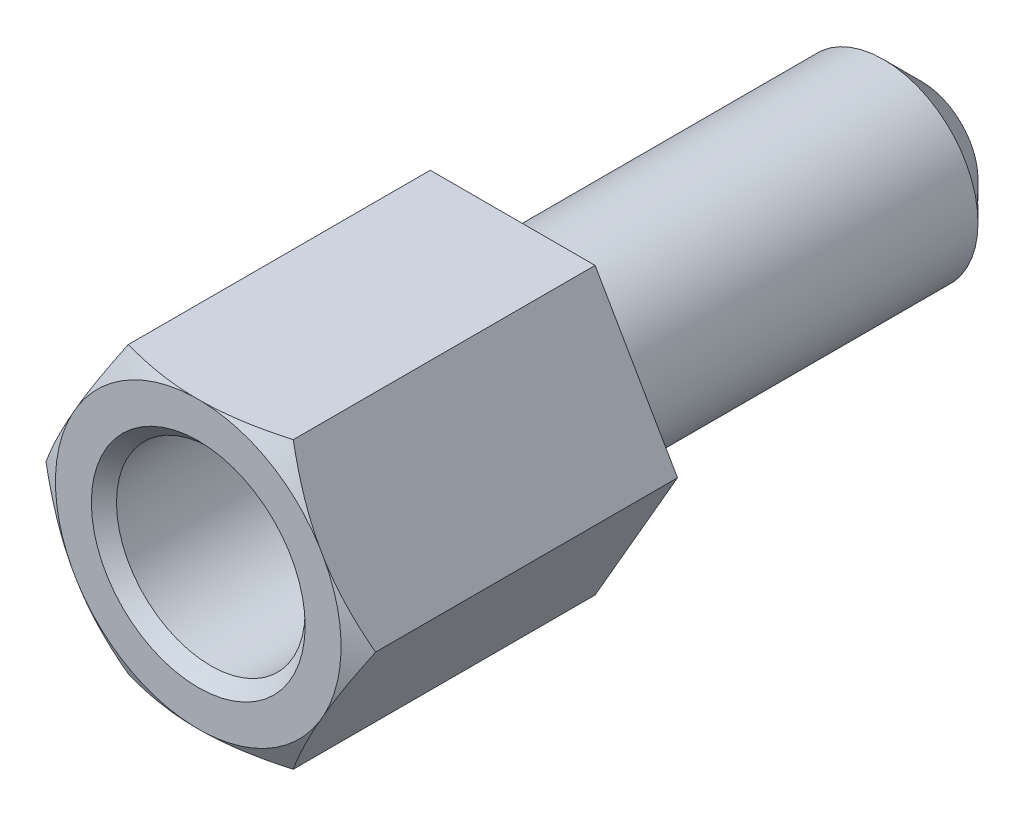
ISO-10303-21;
HEADER;
FILE_DESCRIPTION(('STEP AP214'),'2;1');
FILE_NAME('part.step','',(''),(''),'','','');
FILE_SCHEMA(('AUTOMOTIVE_DESIGN { 1 0 10303 214 1 1 1 1 }'));
ENDSEC;
DATA;
#1=APPLICATION_CONTEXT('core data for automotive mechanical design processes');
#2=APPLICATION_PROTOCOL_DEFINITION('international standard','automotive_design',2000,#1);
#3=PRODUCT_CONTEXT('',#1,'mechanical');
#4=PRODUCT('Part','Part','',(#3));
#5=PRODUCT_RELATED_PRODUCT_CATEGORY('part','',(#4));
#6=PRODUCT_DEFINITION_FORMATION('','',#4);
#7=PRODUCT_DEFINITION_CONTEXT('part definition',#1,'design');
#8=PRODUCT_DEFINITION('design','',#6,#7);
#9=PRODUCT_DEFINITION_SHAPE('','',#8);
#10=(LENGTH_UNIT() NAMED_UNIT(*) SI_UNIT(.MILLI.,.METRE.));
#11=(NAMED_UNIT(*) PLANE_ANGLE_UNIT() SI_UNIT($,.RADIAN.));
#12=(NAMED_UNIT(*) SI_UNIT($,.STERADIAN.) SOLID_ANGLE_UNIT());
#13=UNCERTAINTY_MEASURE_WITH_UNIT(LENGTH_MEASURE(1.E-05),#10,'distance_accuracy_value','');
#14=(GEOMETRIC_REPRESENTATION_CONTEXT(3) GLOBAL_UNCERTAINTY_ASSIGNED_CONTEXT((#13)) GLOBAL_UNIT_ASSIGNED_CONTEXT((#10,
#11,#12)) REPRESENTATION_CONTEXT('',''));
#15=CARTESIAN_POINT('',(0.,0.,0.));
#16=DIRECTION('',(0.,0.,1.));
#17=DIRECTION('',(1.,0.,0.));
#18=AXIS2_PLACEMENT_3D('',#15,#16,#17);
#19=CARTESIAN_POINT('',(0.,0.,5.));
#20=DIRECTION('',(0.,0.,1.));
#21=DIRECTION('',(1.,0.,0.));
#22=AXIS2_PLACEMENT_3D('',#19,#20,#21);
#23=PLANE('',#22);
#24=CARTESIAN_POINT('',(0.,0.,5.));
#25=DIRECTION('',(0.,0.,1.));
#26=DIRECTION('',(1.,0.,0.));
#27=AXIS2_PLACEMENT_3D('',#24,#25,#26);
#28=CIRCLE('',#27,1.7);
#29=CARTESIAN_POINT('',(1.7,0.,5.));
#30=VERTEX_POINT('',#29);
#31=EDGE_CURVE('E162',#30,#30,#28,.F.);
#32=ORIENTED_EDGE('',*,*,#31,.T.);
#33=EDGE_LOOP('',(#32));
#34=FACE_BOUND('',#33,.T.);
#35=CARTESIAN_POINT('',(0.,0.,5.));
#36=DIRECTION('',(0.,0.,1.));
#37=DIRECTION('',(1.,0.,0.));
#38=AXIS2_PLACEMENT_3D('',#35,#36,#37);
#39=CIRCLE('',#38,2.2711702221209);
#40=CARTESIAN_POINT('',(1.92942846272878,-1.19813187298426,5.));
#41=VERTEX_POINT('',#40);
#42=CARTESIAN_POINT('',(0.0728984077241233,-2.27,5.));
#43=VERTEX_POINT('',#42);
#44=EDGE_CURVE('E161',#41,#43,#39,.F.);
#45=ORIENTED_EDGE('',*,*,#44,.F.);
#46=DIRECTION('',(0.499999999999995,0.866025403784442,0.));
#47=VECTOR('',#46,1.);
#48=CARTESIAN_POINT('',(1.31058511106048,-2.26999999999999,5.));
#49=LINE('',#48,#47);
#50=CARTESIAN_POINT('',(2.0023268704526,-1.07186812701572,5.));
#51=VERTEX_POINT('',#50);
#52=EDGE_CURVE('E305',#41,#51,#49,.T.);
#53=ORIENTED_EDGE('',*,*,#52,.T.);
#54=CARTESIAN_POINT('',(2.00232687045273,1.07186812701549,5.));
#55=VERTEX_POINT('',#54);
#56=EDGE_CURVE('E158',#55,#51,#39,.F.);
#57=ORIENTED_EDGE('',*,*,#56,.F.);
#58=DIRECTION('',(-0.500000000000001,0.866025403784438,0.));
#59=VECTOR('',#58,1.);
#60=CARTESIAN_POINT('',(2.6211702221209,0.,5.));
#61=LINE('',#60,#59);
#62=CARTESIAN_POINT('',(1.92942846272862,1.19813187298452,5.));
#63=VERTEX_POINT('',#62);
#64=EDGE_CURVE('E317',#55,#63,#61,.T.);
#65=ORIENTED_EDGE('',*,*,#64,.T.);
#66=CARTESIAN_POINT('',(0.0728984077240917,2.27,5.));
#67=VERTEX_POINT('',#66);
#68=EDGE_CURVE('E160',#67,#63,#39,.F.);
#69=ORIENTED_EDGE('',*,*,#68,.F.);
#70=DIRECTION('',(-1.,0.,0.));
#71=VECTOR('',#70,1.);
#72=CARTESIAN_POINT('',(1.31058511106045,2.27,5.));
#73=LINE('',#72,#71);
#74=CARTESIAN_POINT('',(-0.0728984077241075,2.27,5.));
#75=VERTEX_POINT('',#74);
#76=EDGE_CURVE('E312',#67,#75,#73,.T.);
#77=ORIENTED_EDGE('',*,*,#76,.T.);
#78=CARTESIAN_POINT('',(-1.92942846272863,1.19813187298449,5.));
#79=VERTEX_POINT('',#78);
#80=EDGE_CURVE('E337',#79,#75,#39,.F.);
#81=ORIENTED_EDGE('',*,*,#80,.F.);
#82=DIRECTION('',(-0.499999999999995,-0.866025403784442,0.));
#83=VECTOR('',#82,1.);
#84=CARTESIAN_POINT('',(-1.31058511106046,2.27,5.));
#85=LINE('',#84,#83);
#86=CARTESIAN_POINT('',(-2.00232687045273,1.07186812701548,5.));
#87=VERTEX_POINT('',#86);
#88=EDGE_CURVE('E311',#79,#87,#85,.T.);
#89=ORIENTED_EDGE('',*,*,#88,.T.);
#90=CARTESIAN_POINT('',(-2.00232687045272,-1.0718681270155,5.));
#91=VERTEX_POINT('',#90);
#92=EDGE_CURVE('E122',#91,#87,#39,.F.);
#93=ORIENTED_EDGE('',*,*,#92,.F.);
#94=DIRECTION('',(0.500000000000007,-0.866025403784435,0.));
#95=VECTOR('',#94,1.);
#96=CARTESIAN_POINT('',(-2.6211702221209,0.,5.));
#97=LINE('',#96,#95);
#98=CARTESIAN_POINT('',(-1.92942846272861,-1.19813187298453,5.));
#99=VERTEX_POINT('',#98);
#100=EDGE_CURVE('E138',#91,#99,#97,.T.);
#101=ORIENTED_EDGE('',*,*,#100,.T.);
#102=CARTESIAN_POINT('',(-0.0728984077240759,-2.27,5.));
#103=VERTEX_POINT('',#102);
#104=EDGE_CURVE('E328',#103,#99,#39,.F.);
#105=ORIENTED_EDGE('',*,*,#104,.F.);
#106=DIRECTION('',(1.,0.,0.));
#107=VECTOR('',#106,1.);
#108=CARTESIAN_POINT('',(-1.31058511106043,-2.27000000000001,5.));
#109=LINE('',#108,#107);
#110=EDGE_CURVE('E297',#103,#43,#109,.T.);
#111=ORIENTED_EDGE('',*,*,#110,.T.);
#112=EDGE_LOOP('',(#45,#53,#57,#65,#69,#77,#81,#89,#93,#101,#105,#111));
#113=FACE_BOUND('',#112,.T.);
#114=ADVANCED_FACE('F33',(#34,#113),#23,.T.);
#115=CARTESIAN_POINT('',(1.31058511106048,-2.26999999999999,5.));
#116=DIRECTION('',(-0.866025403784442,0.499999999999995,0.));
#117=DIRECTION('',(-0.499999999999995,-0.866025403784442,0.));
#118=AXIS2_PLACEMENT_3D('',#115,#116,#117);
#119=PLANE('',#118);
#120=DIRECTION('',(0.,0.,-1.));
#121=VECTOR('',#120,1.);
#122=CARTESIAN_POINT('',(2.6211702221209,0.,5.));
#123=LINE('',#122,#121);
#124=CARTESIAN_POINT('',(2.6211702221209,0.,4.8));
#125=VERTEX_POINT('',#124);
#126=CARTESIAN_POINT('',(2.6211702221209,0.,0.));
#127=VERTEX_POINT('',#126);
#128=EDGE_CURVE('E156',#125,#127,#123,.T.);
#129=ORIENTED_EDGE('',*,*,#128,.F.);
#130=CARTESIAN_POINT('',(3.53192502802619,1.5774735970655,4.08741553571821));
#131=CARTESIAN_POINT('',(3.49038683177578,1.50552733070503,4.12584593682828));
#132=CARTESIAN_POINT('',(3.44875020540645,1.43341057837759,4.16385654237284));
#133=CARTESIAN_POINT('',(3.36523806633925,1.28876331046444,4.23884087084839));
#134=CARTESIAN_POINT('',(3.32336252393505,1.21623274342586,4.27581446130192));
#135=CARTESIAN_POINT('',(3.2392041639013,1.07046618796573,4.34863605718441));
#136=CARTESIAN_POINT('',(3.19692046373752,0.997228670950057,4.38448000175645));
#137=CARTESIAN_POINT('',(3.11203872815441,0.850209192285474,4.45463614545671));
#138=CARTESIAN_POINT('',(3.06944070287604,0.776427248201231,4.48894839375192));
#139=CARTESIAN_POINT('',(2.93902958582734,0.550548567601065,4.59073247234419));
#140=CARTESIAN_POINT('',(2.85063034563924,0.397436592244791,4.6552582519314));
#141=CARTESIAN_POINT('',(2.67192637782697,0.087912240479784,4.77245452535466));
#142=CARTESIAN_POINT('',(2.58162393222904,-0.0684961833435527,4.82513842194361));
#143=CARTESIAN_POINT('',(2.42693241398784,-0.336429752437292,4.89926542993134));
#144=CARTESIAN_POINT('',(2.36310804900723,-0.446976795344517,4.9253337082215));
#145=CARTESIAN_POINT('',(2.23458545503782,-0.669584458020093,4.96667159632339));
#146=CARTESIAN_POINT('',(2.16988756118548,-0.781644497315046,4.98194523398376));
#147=CARTESIAN_POINT('',(2.04077595171339,-1.0052723647677,4.99988363065833));
#148=CARTESIAN_POINT('',(1.97636731130573,-1.1168314024002,5.00268918124658));
#149=CARTESIAN_POINT('',(1.84772217135019,-1.33965132095,4.99573180979079));
#150=CARTESIAN_POINT('',(1.78348569252728,-1.45091216597062,4.98596743716207));
#151=CARTESIAN_POINT('',(1.63030365883247,-1.71623123113676,4.94884110275405));
#152=CARTESIAN_POINT('',(1.54169424329177,-1.86970724088223,4.91602386301809));
#153=CARTESIAN_POINT('',(1.36642171508063,-2.17328816491498,4.8337386865889));
#154=CARTESIAN_POINT('',(1.27976131396279,-2.32338838265538,4.78424891904422));
#155=CARTESIAN_POINT('',(1.10733311832964,-2.62204277814941,4.6734296043507));
#156=CARTESIAN_POINT('',(1.0215861268955,-2.77056092390952,4.61197390522853));
#157=CARTESIAN_POINT('',(0.851622526986712,-3.06494651438886,4.48148391942088));
#158=CARTESIAN_POINT('',(0.767405153907297,-3.2108152834424,4.41245354776719));
#159=CARTESIAN_POINT('',(0.635892107966419,-3.43860256087014,4.29990584898817));
#160=CARTESIAN_POINT('',(0.588222071353331,-3.52116948628268,4.258115008667));
#161=CARTESIAN_POINT('',(0.493605207664314,-3.68505070144488,4.17352418104968));
#162=CARTESIAN_POINT('',(0.446655700740956,-3.76636963282644,4.13073619973541));
#163=CARTESIAN_POINT('',(0.399830305155195,-3.84747359706549,4.08741553571821));
#164=B_SPLINE_CURVE_WITH_KNOTS('',3,(#130,#131,#132,#133,#134,#135,#136,#137,#138,#139,#140,
#141,#142,#143,#144,#145,#146,#147,#148,#149,#150,#151,#152,#153,#154,#155,#156,#157,#158,#159,
#160,#161,#162,#163),.UNSPECIFIED.,.F.,.F.,(4,2,2,2,2,2,2,2,2,2,2,2,2,2,2,2,4),(0.,
0.27460604883212,0.549247019939766,0.824783021018256,1.10031017110166,1.66467514911564,
2.22839812072205,2.61888273310892,3.00922156533174,3.39514124414462,3.78110546255823,
4.32061090335236,4.86082553106847,5.40707820220992,5.95304985633497,6.26533246804874,
6.57488685439788),.UNSPECIFIED.);
#165=EDGE_CURVE('E295',#125,#51,#164,.T.);
#166=ORIENTED_EDGE('',*,*,#165,.T.);
#167=ORIENTED_EDGE('',*,*,#52,.F.);
#168=CARTESIAN_POINT('',(1.31058511106048,-2.26999999999999,4.8));
#169=VERTEX_POINT('',#168);
#170=EDGE_CURVE('E139',#41,#169,#164,.T.);
#171=ORIENTED_EDGE('',*,*,#170,.T.);
#172=DIRECTION('',(0.,0.,-1.));
#173=VECTOR('',#172,1.);
#174=CARTESIAN_POINT('',(1.31058511106048,-2.26999999999999,5.));
#175=LINE('',#174,#173);
#176=CARTESIAN_POINT('',(1.31058511106048,-2.26999999999999,0.));
#177=VERTEX_POINT('',#176);
#178=EDGE_CURVE('E151',#169,#177,#175,.T.);
#179=ORIENTED_EDGE('',*,*,#178,.T.);
#180=DIRECTION('',(0.499999999999995,0.866025403784442,0.));
#181=VECTOR('',#180,1.);
#182=CARTESIAN_POINT('',(1.31058511106048,-2.26999999999999,0.));
#183=LINE('',#182,#181);
#184=EDGE_CURVE('E283',#177,#127,#183,.T.);
#185=ORIENTED_EDGE('',*,*,#184,.T.);
#186=EDGE_LOOP('',(#129,#166,#167,#171,#179,#185));
#187=FACE_BOUND('',#186,.T.);
#188=ADVANCED_FACE('F244',(#187),#119,.F.);
#189=CARTESIAN_POINT('',(2.6211702221209,0.,5.));
#190=DIRECTION('',(-0.866025403784438,-0.500000000000001,0.));
#191=DIRECTION('',(0.500000000000001,-0.866025403784438,0.));
#192=AXIS2_PLACEMENT_3D('',#189,#190,#191);
#193=PLANE('',#192);
#194=DIRECTION('',(0.,0.,-1.));
#195=VECTOR('',#194,1.);
#196=CARTESIAN_POINT('',(1.31058511106045,2.27,5.));
#197=LINE('',#196,#195);
#198=CARTESIAN_POINT('',(1.31058511106045,2.27,4.8));
#199=VERTEX_POINT('',#198);
#200=CARTESIAN_POINT('',(1.31058511106045,2.27,0.));
#201=VERTEX_POINT('',#200);
#202=EDGE_CURVE('E149',#199,#201,#197,.T.);
#203=ORIENTED_EDGE('',*,*,#202,.F.);
#204=CARTESIAN_POINT('',(0.399830305155138,3.84747359706553,4.08741553571819));
#205=CARTESIAN_POINT('',(0.441368501405547,3.77552733070505,4.12584593682826));
#206=CARTESIAN_POINT('',(0.483005127774878,3.70341057837761,4.16385654237283));
#207=CARTESIAN_POINT('',(0.566517266842073,3.55876331046447,4.23884087084837));
#208=CARTESIAN_POINT('',(0.608392809246276,3.48623274342588,4.2758144613019));
#209=CARTESIAN_POINT('',(0.692551169280029,3.34046618796575,4.34863605718439));
#210=CARTESIAN_POINT('',(0.734834869443805,3.26722867095008,4.38448000175644));
#211=CARTESIAN_POINT('',(0.81971660502692,3.1202091922855,4.45463614545669));
#212=CARTESIAN_POINT('',(0.862314630305291,3.04642724820126,4.48894839375191));
#213=CARTESIAN_POINT('',(0.992725747353995,2.82054856760109,4.59073247234417));
#214=CARTESIAN_POINT('',(1.08112498754209,2.66743659224482,4.65525825193139));
#215=CARTESIAN_POINT('',(1.25982895535437,2.35791224047981,4.77245452535465));
#216=CARTESIAN_POINT('',(1.3501314009523,2.20150381665648,4.8251384219436));
#217=CARTESIAN_POINT('',(1.5048229191935,1.93357024756274,4.89926542993133));
#218=CARTESIAN_POINT('',(1.5686472841741,1.82302320465551,4.92533370822149));
#219=CARTESIAN_POINT('',(1.69716987814352,1.60041554197994,4.96667159632339));
#220=CARTESIAN_POINT('',(1.76186777199586,1.48835550268499,4.98194523398376));
#221=CARTESIAN_POINT('',(1.89097938146795,1.26472763523234,4.99988363065834));
#222=CARTESIAN_POINT('',(1.95538802187561,1.15316859759984,5.00268918124658));
#223=CARTESIAN_POINT('',(2.08403316183115,0.930348679050041,4.9957318097908));
#224=CARTESIAN_POINT('',(2.14826964065407,0.819087834029423,4.98596743716208));
#225=CARTESIAN_POINT('',(2.30145167434887,0.55376876886329,4.94884110275406));
#226=CARTESIAN_POINT('',(2.39006108988957,0.40029275911782,4.91602386301811));
#227=CARTESIAN_POINT('',(2.56533361810071,0.0967118350850835,4.83373868658892));
#228=CARTESIAN_POINT('',(2.65199401921855,-0.0533883826553175,4.78424891904425));
#229=CARTESIAN_POINT('',(2.82442221485169,-0.352042778149337,4.67342960435073));
#230=CARTESIAN_POINT('',(2.91016920628583,-0.500560923909442,4.61197390522857));
#231=CARTESIAN_POINT('',(3.08013280619461,-0.79494651438877,4.48148391942092));
#232=CARTESIAN_POINT('',(3.16435017927403,-0.940815283442298,4.41245354776724));
#233=CARTESIAN_POINT('',(3.29586322521492,-1.16860256087006,4.29990584898821));
#234=CARTESIAN_POINT('',(3.34353326182802,-1.25116948628262,4.25811500866703));
#235=CARTESIAN_POINT('',(3.43815012551707,-1.41505070144486,4.17352418104969));
#236=CARTESIAN_POINT('',(3.48509963244044,-1.49636963282645,4.13073619973541));
#237=CARTESIAN_POINT('',(3.53192502802621,-1.57747359706552,4.08741553571819));
#238=B_SPLINE_CURVE_WITH_KNOTS('',3,(#204,#205,#206,#207,#208,#209,#210,#211,#212,#213,#214,
#215,#216,#217,#218,#219,#220,#221,#222,#223,#224,#225,#226,#227,#228,#229,#230,#231,#232,#233,
#234,#235,#236,#237),.UNSPECIFIED.,.F.,.F.,(4,2,2,2,2,2,2,2,2,2,2,2,2,2,2,2,4),(0.,
0.27460604883212,0.549247019939767,0.824783021018257,1.10031017110166,1.66467514911565,
2.22839812072206,2.61888273310892,3.00922156533174,3.39514124414462,3.78110546255823,
4.32061090335234,4.86082553106843,5.40707820220987,5.9530498563349,6.26533246804876,
6.57488685439797),.UNSPECIFIED.);
#239=EDGE_CURVE('E229',#199,#63,#238,.T.);
#240=ORIENTED_EDGE('',*,*,#239,.T.);
#241=ORIENTED_EDGE('',*,*,#64,.F.);
#242=EDGE_CURVE('E326',#55,#125,#238,.T.);
#243=ORIENTED_EDGE('',*,*,#242,.T.);
#244=ORIENTED_EDGE('',*,*,#128,.T.);
#245=DIRECTION('',(-0.500000000000001,0.866025403784438,0.));
#246=VECTOR('',#245,1.);
#247=CARTESIAN_POINT('',(2.6211702221209,0.,0.));
#248=LINE('',#247,#246);
#249=EDGE_CURVE('E288',#127,#201,#248,.T.);
#250=ORIENTED_EDGE('',*,*,#249,.T.);
#251=EDGE_LOOP('',(#203,#240,#241,#243,#244,#250));
#252=FACE_BOUND('',#251,.T.);
#253=ADVANCED_FACE('F239',(#252),#193,.F.);
#254=CARTESIAN_POINT('',(1.31058511106045,2.27,5.));
#255=DIRECTION('',(0.,-1.,0.));
#256=DIRECTION('',(1.,0.,0.));
#257=AXIS2_PLACEMENT_3D('',#254,#255,#256);
#258=PLANE('',#257);
#259=DIRECTION('',(0.,0.,-1.));
#260=VECTOR('',#259,1.);
#261=CARTESIAN_POINT('',(-1.31058511106046,2.27,5.));
#262=LINE('',#261,#260);
#263=CARTESIAN_POINT('',(-1.31058511106046,2.27,4.8));
#264=VERTEX_POINT('',#263);
#265=CARTESIAN_POINT('',(-1.31058511106046,2.27,0.));
#266=VERTEX_POINT('',#265);
#267=EDGE_CURVE('E146',#264,#266,#262,.T.);
#268=ORIENTED_EDGE('',*,*,#267,.F.);
#269=CARTESIAN_POINT('',(-2.88805870812598,2.26999999999999,4.19873241033435));
#270=CARTESIAN_POINT('',(-2.80547290408561,2.26999999999999,4.23582553246422));
#271=CARTESIAN_POINT('',(-2.72266390787582,2.26999999999999,4.27243002780974));
#272=CARTESIAN_POINT('',(-2.55650266128481,2.26999999999999,4.3444249566602));
#273=CARTESIAN_POINT('',(-2.47315031505662,2.26999999999999,4.37981516866865));
#274=CARTESIAN_POINT('',(-2.30548338672953,2.26999999999999,4.44927692229812));
#275=CARTESIAN_POINT('',(-2.22116623150816,2.26999999999999,4.48334228843963));
#276=CARTESIAN_POINT('',(-2.0518277990544,2.26999999999999,4.54965954573777));
#277=CARTESIAN_POINT('',(-1.96680655448942,2.26999999999999,4.58191152049492));
#278=CARTESIAN_POINT('',(-1.71138311857313,2.26999999999999,4.67506560418586));
#279=CARTESIAN_POINT('',(-1.53976972748373,2.26999999999999,4.73272686586936));
#280=CARTESIAN_POINT('',(-1.19280228070999,2.27,4.83494216041644));
#281=CARTESIAN_POINT('',(-1.01745424532612,2.27,4.87951579480202));
#282=CARTESIAN_POINT('',(-0.712090771389097,2.27,4.94007199547372));
#283=CARTESIAN_POINT('',(-0.582987722953633,2.27,4.96055533863026));
#284=CARTESIAN_POINT('',(-0.323439084569064,2.27,4.98958123352197));
#285=CARTESIAN_POINT('',(-0.192993977067357,2.27,4.99812793490839));
#286=CARTESIAN_POINT('',(0.0680599454393651,2.27,5.00222736308739));
#287=CARTESIAN_POINT('',(0.198668678458169,2.27,4.9977850727737));
#288=CARTESIAN_POINT('',(0.458851198221914,2.27,4.97648569269902));
#289=CARTESIAN_POINT('',(0.588424742955663,2.27,4.95962578105718));
#290=CARTESIAN_POINT('',(0.904937752962705,2.27,4.90516079530181));
#291=CARTESIAN_POINT('',(1.0908347749352,2.27,4.86157940431848));
#292=CARTESIAN_POINT('',(1.36639728986908,2.27,4.78449647659567));
#293=CARTESIAN_POINT('',(1.45781153661095,2.27,4.75681025363438));
#294=CARTESIAN_POINT('',(1.6396189959448,2.27000000000001,4.69825910905325));
#295=CARTESIAN_POINT('',(1.73001229033943,2.27000000000001,4.66739444413639));
#296=CARTESIAN_POINT('',(1.9107725748706,2.27000000000001,4.6027837141474));
#297=CARTESIAN_POINT('',(2.00113026057096,2.27000000000001,4.56901191899239));
#298=CARTESIAN_POINT('',(2.18103313876787,2.27000000000001,4.49936027894403));
#299=CARTESIAN_POINT('',(2.27057828364603,2.27000000000001,4.46348031141209));
#300=CARTESIAN_POINT('',(2.44846011178725,2.27000000000001,4.3902269588395));
#301=CARTESIAN_POINT('',(2.53680076536778,2.27000000000001,4.35286316680602));
#302=CARTESIAN_POINT('',(2.71286376090328,2.27000000000001,4.2767584059864));
#303=CARTESIAN_POINT('',(2.80058623966965,2.27000000000001,4.2380177541729));
#304=CARTESIAN_POINT('',(2.88805870812597,2.27000000000001,4.19873241033435));
#305=B_SPLINE_CURVE_WITH_KNOTS('',3,(#269,#270,#271,#272,#273,#274,#275,#276,#277,#278,#279,
#280,#281,#282,#283,#284,#285,#286,#287,#288,#289,#290,#291,#292,#293,#294,#295,#296,#297,#298,
#299,#300,#301,#302,#303,#304),.UNSPECIFIED.,.F.,.F.,(4,2,2,2,2,2,2,2,2,2,2,2,2,2,2,2,2,4),(0.,
0.271603728461577,0.543256739373973,0.816052841064958,1.08883635604999,1.63163153509609,
2.17360956621752,2.56530041766829,2.95685506788358,3.34825952790361,3.73975296129816,
4.31141566486301,4.59793246001127,4.88442613310068,5.17378506531957,5.46316084709716,
5.75090015934329,6.03857365362724),.UNSPECIFIED.);
#306=EDGE_CURVE('E221',#264,#75,#305,.T.);
#307=ORIENTED_EDGE('',*,*,#306,.T.);
#308=ORIENTED_EDGE('',*,*,#76,.F.);
#309=EDGE_CURVE('E228',#67,#199,#305,.T.);
#310=ORIENTED_EDGE('',*,*,#309,.T.);
#311=ORIENTED_EDGE('',*,*,#202,.T.);
#312=DIRECTION('',(-1.,0.,0.));
#313=VECTOR('',#312,1.);
#314=CARTESIAN_POINT('',(1.31058511106045,2.27,0.));
#315=LINE('',#314,#313);
#316=EDGE_CURVE('E292',#201,#266,#315,.T.);
#317=ORIENTED_EDGE('',*,*,#316,.T.);
#318=EDGE_LOOP('',(#268,#307,#308,#310,#311,#317));
#319=FACE_BOUND('',#318,.T.);
#320=ADVANCED_FACE('F236',(#319),#258,.F.);
#321=CARTESIAN_POINT('',(-1.31058511106046,2.27,5.));
#322=DIRECTION('',(0.866025403784442,-0.499999999999995,0.));
#323=DIRECTION('',(0.499999999999995,0.866025403784442,0.));
#324=AXIS2_PLACEMENT_3D('',#321,#322,#323);
#325=PLANE('',#324);
#326=DIRECTION('',(0.,0.,-1.));
#327=VECTOR('',#326,1.);
#328=CARTESIAN_POINT('',(-2.6211702221209,0.,5.));
#329=LINE('',#328,#327);
#330=CARTESIAN_POINT('',(-2.6211702221209,0.,4.8));
#331=VERTEX_POINT('',#330);
#332=CARTESIAN_POINT('',(-2.6211702221209,0.,0.));
#333=VERTEX_POINT('',#332);
#334=EDGE_CURVE('E134',#331,#333,#329,.T.);
#335=ORIENTED_EDGE('',*,*,#334,.F.);
#336=CARTESIAN_POINT('',(-3.5319250280262,-1.57747359706554,4.0874155357182));
#337=CARTESIAN_POINT('',(-3.49038683177579,-1.50552733070506,4.12584593682826));
#338=CARTESIAN_POINT('',(-3.44875020540646,-1.43341057837762,4.16385654237283));
#339=CARTESIAN_POINT('',(-3.36523806633926,-1.28876331046448,4.23884087084838));
#340=CARTESIAN_POINT('',(-3.32336252393506,-1.2162327434259,4.2758144613019));
#341=CARTESIAN_POINT('',(-3.23920416390131,-1.07046618796576,4.3486360571844));
#342=CARTESIAN_POINT('',(-3.19692046373753,-0.997228670950094,4.38448000175644));
#343=CARTESIAN_POINT('',(-3.11203872815442,-0.850209192285511,4.45463614545669));
#344=CARTESIAN_POINT('',(-3.06944070287605,-0.776427248201269,4.48894839375191));
#345=CARTESIAN_POINT('',(-2.93902958582735,-0.550548567601102,4.59073247234418));
#346=CARTESIAN_POINT('',(-2.85063034563925,-0.397436592244829,4.65525825193139));
#347=CARTESIAN_POINT('',(-2.67192637782698,-0.0879122404798214,4.77245452535465));
#348=CARTESIAN_POINT('',(-2.58162393222905,0.0684961833435154,4.82513842194361));
#349=CARTESIAN_POINT('',(-2.42693241398785,0.336429752437254,4.89926542993133));
#350=CARTESIAN_POINT('',(-2.36310804900725,0.446976795344478,4.92533370822149));
#351=CARTESIAN_POINT('',(-2.23458545503783,0.669584458020053,4.96667159632339));
#352=CARTESIAN_POINT('',(-2.16988756118549,0.781644497315006,4.98194523398376));
#353=CARTESIAN_POINT('',(-2.0407759517134,1.00527236476766,4.99988363065834));
#354=CARTESIAN_POINT('',(-1.97636731130574,1.11683140240015,5.00268918124658));
#355=CARTESIAN_POINT('',(-1.84772217135021,1.33965132094996,4.9957318097908));
#356=CARTESIAN_POINT('',(-1.78348569252729,1.45091216597057,4.98596743716208));
#357=CARTESIAN_POINT('',(-1.63030365883248,1.71623123113671,4.94884110275406));
#358=CARTESIAN_POINT('',(-1.54169424329179,1.86970724088218,4.91602386301811));
#359=CARTESIAN_POINT('',(-1.36642171508065,2.17328816491492,4.83373868658892));
#360=CARTESIAN_POINT('',(-1.27976131396281,2.32338838265532,4.78424891904425));
#361=CARTESIAN_POINT('',(-1.10733311832968,2.62204277814934,4.67342960435073));
#362=CARTESIAN_POINT('',(-1.02158612689554,2.77056092390945,4.61197390522857));
#363=CARTESIAN_POINT('',(-0.85162252698675,3.06494651438878,4.48148391942092));
#364=CARTESIAN_POINT('',(-0.767405153907337,3.21081528344231,4.41245354776723));
#365=CARTESIAN_POINT('',(-0.635892107966449,3.43860256087007,4.2999058489882));
#366=CARTESIAN_POINT('',(-0.588222071353349,3.52116948628263,4.25811500866703));
#367=CARTESIAN_POINT('',(-0.493605207664309,3.68505070144486,4.17352418104969));
#368=CARTESIAN_POINT('',(-0.44665570074094,3.76636963282645,4.13073619973541));
#369=CARTESIAN_POINT('',(-0.399830305155167,3.84747359706552,4.0874155357182));
#370=B_SPLINE_CURVE_WITH_KNOTS('',3,(#336,#337,#338,#339,#340,#341,#342,#343,#344,#345,#346,
#347,#348,#349,#350,#351,#352,#353,#354,#355,#356,#357,#358,#359,#360,#361,#362,#363,#364,#365,
#366,#367,#368,#369),.UNSPECIFIED.,.F.,.F.,(4,2,2,2,2,2,2,2,2,2,2,2,2,2,2,2,4),(0.,
0.274606048832121,0.549247019939767,0.824783021018257,1.10031017110166,1.66467514911564,
2.22839812072205,2.61888273310892,3.00922156533174,3.39514124414462,3.78110546255823,
4.32061090335234,4.86082553106843,5.40707820220987,5.95304985633491,6.26533246804875,
6.57488685439796),.UNSPECIFIED.);
#371=EDGE_CURVE('E120',#331,#87,#370,.T.);
#372=ORIENTED_EDGE('',*,*,#371,.T.);
#373=ORIENTED_EDGE('',*,*,#88,.F.);
#374=EDGE_CURVE('E127',#79,#264,#370,.T.);
#375=ORIENTED_EDGE('',*,*,#374,.T.);
#376=ORIENTED_EDGE('',*,*,#267,.T.);
#377=DIRECTION('',(-0.499999999999995,-0.866025403784442,0.));
#378=VECTOR('',#377,1.);
#379=CARTESIAN_POINT('',(-1.31058511106046,2.27,0.));
#380=LINE('',#379,#378);
#381=EDGE_CURVE('E144',#266,#333,#380,.T.);
#382=ORIENTED_EDGE('',*,*,#381,.T.);
#383=EDGE_LOOP('',(#335,#372,#373,#375,#376,#382));
#384=FACE_BOUND('',#383,.T.);
#385=ADVANCED_FACE('F142',(#384),#325,.F.);
#386=CARTESIAN_POINT('',(-2.6211702221209,0.,5.));
#387=DIRECTION('',(0.866025403784435,0.500000000000007,0.));
#388=DIRECTION('',(-0.500000000000007,0.866025403784435,0.));
#389=AXIS2_PLACEMENT_3D('',#386,#387,#388);
#390=PLANE('',#389);
#391=DIRECTION('',(0.,0.,-1.));
#392=VECTOR('',#391,1.);
#393=CARTESIAN_POINT('',(-1.31058511106043,-2.27000000000001,5.));
#394=LINE('',#393,#392);
#395=CARTESIAN_POINT('',(-1.31058511106043,-2.27000000000001,4.8));
#396=VERTEX_POINT('',#395);
#397=CARTESIAN_POINT('',(-1.31058511106043,-2.27000000000001,0.));
#398=VERTEX_POINT('',#397);
#399=EDGE_CURVE('E147',#396,#398,#394,.T.);
#400=ORIENTED_EDGE('',*,*,#399,.F.);
#401=CARTESIAN_POINT('',(-0.399830305155107,-3.84747359706554,4.08741553571819));
#402=CARTESIAN_POINT('',(-0.441368501405517,-3.77552733070506,4.12584593682826));
#403=CARTESIAN_POINT('',(-0.483005127774847,-3.70341057837762,4.16385654237282));
#404=CARTESIAN_POINT('',(-0.566517266842045,-3.55876331046448,4.23884087084837));
#405=CARTESIAN_POINT('',(-0.608392809246248,-3.4862327434259,4.27581446130189));
#406=CARTESIAN_POINT('',(-0.692551169280002,-3.34046618796576,4.34863605718439));
#407=CARTESIAN_POINT('',(-0.734834869443778,-3.26722867095009,4.38448000175644));
#408=CARTESIAN_POINT('',(-0.819716605026895,-3.12020919228551,4.45463614545669));
#409=CARTESIAN_POINT('',(-0.862314630305267,-3.04642724820127,4.4889483937519));
#410=CARTESIAN_POINT('',(-0.992725747353972,-2.8205485676011,4.59073247234417));
#411=CARTESIAN_POINT('',(-1.08112498754207,-2.66743659224483,4.65525825193139));
#412=CARTESIAN_POINT('',(-1.25982895535435,-2.35791224047983,4.77245452535465));
#413=CARTESIAN_POINT('',(-1.35013140095228,-2.20150381665649,4.8251384219436));
#414=CARTESIAN_POINT('',(-1.50482291919348,-1.93357024756275,4.89926542993133));
#415=CARTESIAN_POINT('',(-1.56864728417409,-1.82302320465553,4.92533370822149));
#416=CARTESIAN_POINT('',(-1.69716987814351,-1.60041554197996,4.96667159632339));
#417=CARTESIAN_POINT('',(-1.76186777199585,-1.48835550268501,4.98194523398376));
#418=CARTESIAN_POINT('',(-1.89097938146794,-1.26472763523236,4.99988363065834));
#419=CARTESIAN_POINT('',(-1.9553880218756,-1.15316859759986,5.00268918124658));
#420=CARTESIAN_POINT('',(-2.08403316183114,-0.930348679050061,4.9957318097908));
#421=CARTESIAN_POINT('',(-2.14826964065406,-0.819087834029443,4.98596743716208));
#422=CARTESIAN_POINT('',(-2.30145167434887,-0.553768768863312,4.94884110275406));
#423=CARTESIAN_POINT('',(-2.39006108988956,-0.400292759117843,4.91602386301811));
#424=CARTESIAN_POINT('',(-2.5653336181007,-0.096711835085109,4.83373868658892));
#425=CARTESIAN_POINT('',(-2.65199401921855,0.0533883826552912,4.78424891904425));
#426=CARTESIAN_POINT('',(-2.82442221485168,0.352042778149309,4.67342960435073));
#427=CARTESIAN_POINT('',(-2.91016920628583,0.500560923909414,4.61197390522858));
#428=CARTESIAN_POINT('',(-3.08013280619461,0.79494651438874,4.48148391942093));
#429=CARTESIAN_POINT('',(-3.16435017927403,0.940815283442267,4.41245354776724));
#430=CARTESIAN_POINT('',(-3.29586322521492,1.16860256087003,4.29990584898821));
#431=CARTESIAN_POINT('',(-3.34353326182803,1.25116948628259,4.25811500866703));
#432=CARTESIAN_POINT('',(-3.43815012551708,1.41505070144484,4.17352418104969));
#433=CARTESIAN_POINT('',(-3.48509963244045,1.49636963282643,4.1307361997354));
#434=CARTESIAN_POINT('',(-3.53192502802623,1.5774735970655,4.08741553571819));
#435=B_SPLINE_CURVE_WITH_KNOTS('',3,(#401,#402,#403,#404,#405,#406,#407,#408,#409,#410,#411,
#412,#413,#414,#415,#416,#417,#418,#419,#420,#421,#422,#423,#424,#425,#426,#427,#428,#429,#430,
#431,#432,#433,#434),.UNSPECIFIED.,.F.,.F.,(4,2,2,2,2,2,2,2,2,2,2,2,2,2,2,2,4),(0.,
0.274606048832121,0.549247019939768,0.824783021018258,1.10031017110167,1.66467514911565,
2.22839812072206,2.61888273310892,3.00922156533174,3.39514124414462,3.78110546255823,
4.32061090335234,4.86082553106843,5.40707820220987,5.9530498563349,6.26533246804876,
6.57488685439799),.UNSPECIFIED.);
#436=EDGE_CURVE('E141',#396,#99,#435,.T.);
#437=ORIENTED_EDGE('',*,*,#436,.T.);
#438=ORIENTED_EDGE('',*,*,#100,.F.);
#439=EDGE_CURVE('E56',#91,#331,#435,.T.);
#440=ORIENTED_EDGE('',*,*,#439,.T.);
#441=ORIENTED_EDGE('',*,*,#334,.T.);
#442=DIRECTION('',(0.500000000000007,-0.866025403784435,0.));
#443=VECTOR('',#442,1.);
#444=CARTESIAN_POINT('',(-2.6211702221209,0.,0.));
#445=LINE('',#444,#443);
#446=EDGE_CURVE('E303',#333,#398,#445,.T.);
#447=ORIENTED_EDGE('',*,*,#446,.T.);
#448=EDGE_LOOP('',(#400,#437,#438,#440,#441,#447));
#449=FACE_BOUND('',#448,.T.);
#450=ADVANCED_FACE('F132',(#449),#390,.F.);
#451=CARTESIAN_POINT('',(-1.31058511106043,-2.27000000000001,5.));
#452=DIRECTION('',(0.,1.,0.));
#453=DIRECTION('',(-1.,0.,0.));
#454=AXIS2_PLACEMENT_3D('',#451,#452,#453);
#455=PLANE('',#454);
#456=ORIENTED_EDGE('',*,*,#178,.F.);
#457=CARTESIAN_POINT('',(2.888058708126,-2.26999999999997,4.19873241033435));
#458=CARTESIAN_POINT('',(2.80547290408563,-2.26999999999997,4.23582553246422));
#459=CARTESIAN_POINT('',(2.72266390787583,-2.26999999999997,4.27243002780974));
#460=CARTESIAN_POINT('',(2.55650266128482,-2.26999999999997,4.3444249566602));
#461=CARTESIAN_POINT('',(2.47315031505664,-2.26999999999997,4.37981516866865));
#462=CARTESIAN_POINT('',(2.30548338672954,-2.26999999999998,4.44927692229812));
#463=CARTESIAN_POINT('',(2.22116623150817,-2.26999999999998,4.48334228843963));
#464=CARTESIAN_POINT('',(2.05182779905441,-2.26999999999998,4.54965954573777));
#465=CARTESIAN_POINT('',(1.96680655448944,-2.26999999999998,4.58191152049492));
#466=CARTESIAN_POINT('',(1.71138311857315,-2.26999999999998,4.67506560418587));
#467=CARTESIAN_POINT('',(1.53976972748375,-2.26999999999998,4.73272686586936));
#468=CARTESIAN_POINT('',(1.19280228071,-2.26999999999999,4.83494216041644));
#469=CARTESIAN_POINT('',(1.01745424532614,-2.26999999999999,4.87951579480202));
#470=CARTESIAN_POINT('',(0.712090771389112,-2.26999999999999,4.94007199547372));
#471=CARTESIAN_POINT('',(0.582987722953648,-2.26999999999999,4.96055533863026));
#472=CARTESIAN_POINT('',(0.323439084569079,-2.27,4.98958123352197));
#473=CARTESIAN_POINT('',(0.192993977067372,-2.27,4.99812793490839));
#474=CARTESIAN_POINT('',(-0.0680599454393499,-2.27,5.00222736308739));
#475=CARTESIAN_POINT('',(-0.198668678458154,-2.27,4.9977850727737));
#476=CARTESIAN_POINT('',(-0.458851198221898,-2.27,4.97648569269902));
#477=CARTESIAN_POINT('',(-0.588424742955648,-2.27000000000001,4.95962578105719));
#478=CARTESIAN_POINT('',(-0.904937752962689,-2.27000000000001,4.90516079530181));
#479=CARTESIAN_POINT('',(-1.09083477493518,-2.27000000000001,4.86157940431848));
#480=CARTESIAN_POINT('',(-1.36639728986906,-2.27000000000001,4.78449647659567));
#481=CARTESIAN_POINT('',(-1.45781153661094,-2.27000000000002,4.75681025363438));
#482=CARTESIAN_POINT('',(-1.63961899594478,-2.27000000000002,4.69825910905325));
#483=CARTESIAN_POINT('',(-1.73001229033941,-2.27000000000002,4.66739444413639));
#484=CARTESIAN_POINT('',(-1.91077257487058,-2.27000000000002,4.6027837141474));
#485=CARTESIAN_POINT('',(-2.00113026057094,-2.27000000000002,4.56901191899239));
#486=CARTESIAN_POINT('',(-2.18103313876785,-2.27000000000002,4.49936027894403));
#487=CARTESIAN_POINT('',(-2.27057828364601,-2.27000000000002,4.46348031141209));
#488=CARTESIAN_POINT('',(-2.44846011178723,-2.27000000000003,4.3902269588395));
#489=CARTESIAN_POINT('',(-2.53680076536776,-2.27000000000003,4.35286316680602));
#490=CARTESIAN_POINT('',(-2.71286376090327,-2.27000000000003,4.2767584059864));
#491=CARTESIAN_POINT('',(-2.80058623966963,-2.27000000000003,4.2380177541729));
#492=CARTESIAN_POINT('',(-2.88805870812595,-2.27000000000003,4.19873241033435));
#493=B_SPLINE_CURVE_WITH_KNOTS('',3,(#457,#458,#459,#460,#461,#462,#463,#464,#465,#466,#467,
#468,#469,#470,#471,#472,#473,#474,#475,#476,#477,#478,#479,#480,#481,#482,#483,#484,#485,#486,
#487,#488,#489,#490,#491,#492),.UNSPECIFIED.,.F.,.F.,(4,2,2,2,2,2,2,2,2,2,2,2,2,2,2,2,2,4),(0.,
0.271603728461577,0.543256739373972,0.816052841064958,1.08883635604999,1.63163153509609,
2.17360956621752,2.56530041766829,2.95685506788358,3.34825952790361,3.73975296129816,
4.31141566486301,4.59793246001127,4.88442613310068,5.17378506531957,5.46316084709716,
5.75090015934329,6.03857365362724),.UNSPECIFIED.);
#494=EDGE_CURVE('E182',#169,#43,#493,.T.);
#495=ORIENTED_EDGE('',*,*,#494,.T.);
#496=ORIENTED_EDGE('',*,*,#110,.F.);
#497=EDGE_CURVE('E48',#103,#396,#493,.T.);
#498=ORIENTED_EDGE('',*,*,#497,.T.);
#499=ORIENTED_EDGE('',*,*,#399,.T.);
#500=DIRECTION('',(1.,0.,0.));
#501=VECTOR('',#500,1.);
#502=CARTESIAN_POINT('',(-1.31058511106043,-2.27000000000001,0.));
#503=LINE('',#502,#501);
#504=EDGE_CURVE('E285',#398,#177,#503,.T.);
#505=ORIENTED_EDGE('',*,*,#504,.T.);
#506=EDGE_LOOP('',(#456,#495,#496,#498,#499,#505));
#507=FACE_BOUND('',#506,.T.);
#508=ADVANCED_FACE('F189',(#507),#455,.F.);
#509=CARTESIAN_POINT('',(0.,0.,0.));
#510=DIRECTION('',(0.,0.,1.));
#511=DIRECTION('',(1.,0.,0.));
#512=AXIS2_PLACEMENT_3D('',#509,#510,#511);
#513=PLANE('',#512);
#514=CARTESIAN_POINT('',(0.,0.,0.));
#515=DIRECTION('',(0.,0.,-1.));
#516=DIRECTION('',(-1.,0.,0.));
#517=AXIS2_PLACEMENT_3D('',#514,#515,#516);
#518=CIRCLE('',#517,1.5);
#519=CARTESIAN_POINT('',(-1.5,0.,0.));
#520=VERTEX_POINT('',#519);
#521=EDGE_CURVE('E167',#520,#520,#518,.T.);
#522=ORIENTED_EDGE('',*,*,#521,.F.);
#523=EDGE_LOOP('',(#522));
#524=FACE_BOUND('',#523,.T.);
#525=ORIENTED_EDGE('',*,*,#184,.F.);
#526=ORIENTED_EDGE('',*,*,#504,.F.);
#527=ORIENTED_EDGE('',*,*,#446,.F.);
#528=ORIENTED_EDGE('',*,*,#381,.F.);
#529=ORIENTED_EDGE('',*,*,#316,.F.);
#530=ORIENTED_EDGE('',*,*,#249,.F.);
#531=EDGE_LOOP('',(#525,#526,#527,#528,#529,#530));
#532=FACE_BOUND('',#531,.T.);
#533=ADVANCED_FACE('F269',(#524,#532),#513,.F.);
#534=CARTESIAN_POINT('',(0.,0.,5.000012));
#535=DIRECTION('',(0.,0.,-1.));
#536=DIRECTION('',(-1.,0.,0.));
#537=AXIS2_PLACEMENT_3D('',#534,#535,#536);
#538=CYLINDRICAL_SURFACE('',#537,1.5);
#539=CARTESIAN_POINT('',(0.,0.,4.8));
#540=DIRECTION('',(0.,0.,1.));
#541=DIRECTION('',(1.,0.,0.));
#542=AXIS2_PLACEMENT_3D('',#539,#540,#541);
#543=CIRCLE('',#542,1.5);
#544=CARTESIAN_POINT('',(1.5,0.,4.8));
#545=VERTEX_POINT('',#544);
#546=EDGE_CURVE('E165',#545,#545,#543,.T.);
#547=ORIENTED_EDGE('',*,*,#546,.T.);
#548=EDGE_LOOP('',(#547));
#549=FACE_BOUND('',#548,.T.);
#550=CARTESIAN_POINT('',(0.,0.,1.));
#551=DIRECTION('',(0.,0.,1.));
#552=DIRECTION('',(1.,0.,0.));
#553=AXIS2_PLACEMENT_3D('',#550,#551,#552);
#554=CIRCLE('',#553,1.5);
#555=CARTESIAN_POINT('',(1.5,0.,1.));
#556=VERTEX_POINT('',#555);
#557=EDGE_CURVE('E290',#556,#556,#554,.T.);
#558=ORIENTED_EDGE('',*,*,#557,.F.);
#559=EDGE_LOOP('',(#558));
#560=FACE_BOUND('',#559,.T.);
#561=ADVANCED_FACE('F268',(#549,#560),#538,.F.);
#562=CARTESIAN_POINT('',(0.,0.,1.));
#563=DIRECTION('',(0.,0.,1.));
#564=DIRECTION('',(1.,0.,0.));
#565=AXIS2_PLACEMENT_3D('',#562,#563,#564);
#566=PLANE('',#565);
#567=ORIENTED_EDGE('',*,*,#557,.T.);
#568=EDGE_LOOP('',(#567));
#569=FACE_BOUND('',#568,.T.);
#570=ADVANCED_FACE('F198',(#569),#566,.T.);
#571=CARTESIAN_POINT('',(0.,0.,5.));
#572=DIRECTION('',(0.,0.,-1.));
#573=DIRECTION('',(-1.,0.,0.));
#574=AXIS2_PLACEMENT_3D('',#571,#572,#573);
#575=CONICAL_SURFACE('',#574,2.2711702221209,1.05165021254837);
#576=ORIENTED_EDGE('',*,*,#242,.F.);
#577=ORIENTED_EDGE('',*,*,#56,.T.);
#578=ORIENTED_EDGE('',*,*,#165,.F.);
#579=EDGE_LOOP('',(#576,#577,#578));
#580=FACE_BOUND('',#579,.T.);
#581=ADVANCED_FACE('F192',(#580),#575,.T.);
#582=ORIENTED_EDGE('',*,*,#309,.F.);
#583=ORIENTED_EDGE('',*,*,#68,.T.);
#584=ORIENTED_EDGE('',*,*,#239,.F.);
#585=EDGE_LOOP('',(#582,#583,#584));
#586=FACE_BOUND('',#585,.T.);
#587=ADVANCED_FACE('F197',(#586),#575,.T.);
#588=ORIENTED_EDGE('',*,*,#374,.F.);
#589=ORIENTED_EDGE('',*,*,#80,.T.);
#590=ORIENTED_EDGE('',*,*,#306,.F.);
#591=EDGE_LOOP('',(#588,#589,#590));
#592=FACE_BOUND('',#591,.T.);
#593=ADVANCED_FACE('F340',(#592),#575,.T.);
#594=ORIENTED_EDGE('',*,*,#439,.F.);
#595=ORIENTED_EDGE('',*,*,#92,.T.);
#596=ORIENTED_EDGE('',*,*,#371,.F.);
#597=EDGE_LOOP('',(#594,#595,#596));
#598=FACE_BOUND('',#597,.T.);
#599=ADVANCED_FACE('F121',(#598),#575,.T.);
#600=ORIENTED_EDGE('',*,*,#497,.F.);
#601=ORIENTED_EDGE('',*,*,#104,.T.);
#602=ORIENTED_EDGE('',*,*,#436,.F.);
#603=EDGE_LOOP('',(#600,#601,#602));
#604=FACE_BOUND('',#603,.T.);
#605=ADVANCED_FACE('F200',(#604),#575,.T.);
#606=ORIENTED_EDGE('',*,*,#44,.T.);
#607=ORIENTED_EDGE('',*,*,#494,.F.);
#608=ORIENTED_EDGE('',*,*,#170,.F.);
#609=EDGE_LOOP('',(#606,#607,#608));
#610=FACE_BOUND('',#609,.T.);
#611=ADVANCED_FACE('F251',(#610),#575,.T.);
#612=CARTESIAN_POINT('',(0.,0.,5.));
#613=DIRECTION('',(0.,0.,1.));
#614=DIRECTION('',(1.,0.,0.));
#615=AXIS2_PLACEMENT_3D('',#612,#613,#614);
#616=CONICAL_SURFACE('',#615,1.7,0.785398163397444);
#617=ORIENTED_EDGE('',*,*,#546,.F.);
#618=EDGE_LOOP('',(#617));
#619=FACE_BOUND('',#618,.T.);
#620=ORIENTED_EDGE('',*,*,#31,.F.);
#621=EDGE_LOOP('',(#620));
#622=FACE_BOUND('',#621,.T.);
#623=ADVANCED_FACE('F249',(#619,#622),#616,.F.);
#624=CARTESIAN_POINT('',(0.,0.,-6.5));
#625=DIRECTION('',(0.,0.,1.));
#626=DIRECTION('',(1.,0.,0.));
#627=AXIS2_PLACEMENT_3D('',#624,#625,#626);
#628=CYLINDRICAL_SURFACE('',#627,1.5);
#629=CARTESIAN_POINT('',(0.,0.,-5.9));
#630=DIRECTION('',(0.,0.,-1.));
#631=DIRECTION('',(-1.,0.,0.));
#632=AXIS2_PLACEMENT_3D('',#629,#630,#631);
#633=CIRCLE('',#632,1.5);
#634=CARTESIAN_POINT('',(-1.5,0.,-5.9));
#635=VERTEX_POINT('',#634);
#636=EDGE_CURVE('E11',#635,#635,#633,.F.);
#637=ORIENTED_EDGE('',*,*,#636,.T.);
#638=EDGE_LOOP('',(#637));
#639=FACE_BOUND('',#638,.T.);
#640=ORIENTED_EDGE('',*,*,#521,.T.);
#641=EDGE_LOOP('',(#640));
#642=FACE_BOUND('',#641,.T.);
#643=ADVANCED_FACE('F201',(#639,#642),#628,.T.);
#644=CARTESIAN_POINT('',(0.,0.,-6.5));
#645=DIRECTION('',(0.,0.,-1.));
#646=DIRECTION('',(-1.,0.,0.));
#647=AXIS2_PLACEMENT_3D('',#644,#645,#646);
#648=PLANE('',#647);
#649=CARTESIAN_POINT('',(0.,0.,-6.5));
#650=DIRECTION('',(0.,0.,-1.));
#651=DIRECTION('',(-1.,0.,0.));
#652=AXIS2_PLACEMENT_3D('',#649,#650,#651);
#653=CIRCLE('',#652,0.900000000000006);
#654=CARTESIAN_POINT('',(-0.900000000000006,0.,-6.5));
#655=VERTEX_POINT('',#654);
#656=EDGE_CURVE('E41',#655,#655,#653,.T.);
#657=ORIENTED_EDGE('',*,*,#656,.T.);
#658=EDGE_LOOP('',(#657));
#659=FACE_BOUND('',#658,.T.);
#660=ADVANCED_FACE('F257',(#659),#648,.T.);
#661=CARTESIAN_POINT('',(0.,0.,-6.5));
#662=DIRECTION('',(0.,0.,1.));
#663=DIRECTION('',(1.,0.,0.));
#664=AXIS2_PLACEMENT_3D('',#661,#662,#663);
#665=CONICAL_SURFACE('',#664,0.900000000000006,0.785398163397447);
#666=ORIENTED_EDGE('',*,*,#636,.F.);
#667=EDGE_LOOP('',(#666));
#668=FACE_BOUND('',#667,.T.);
#669=ORIENTED_EDGE('',*,*,#656,.F.);
#670=EDGE_LOOP('',(#669));
#671=FACE_BOUND('',#670,.T.);
#672=ADVANCED_FACE('F35',(#668,#671),#665,.T.);
#673=CLOSED_SHELL('',(#114,#188,#253,#320,#385,#450,#508,#533,#561,#570,#581,#587,#593,#599,
#605,#611,#623,#643,#660,#672));
#674=MANIFOLD_SOLID_BREP('B2',#673);
#675=ADVANCED_BREP_SHAPE_REPRESENTATION('',(#18,#674),#14);
#676=SHAPE_DEFINITION_REPRESENTATION(#9,#675);
ENDSEC;
END-ISO-10303-21;
